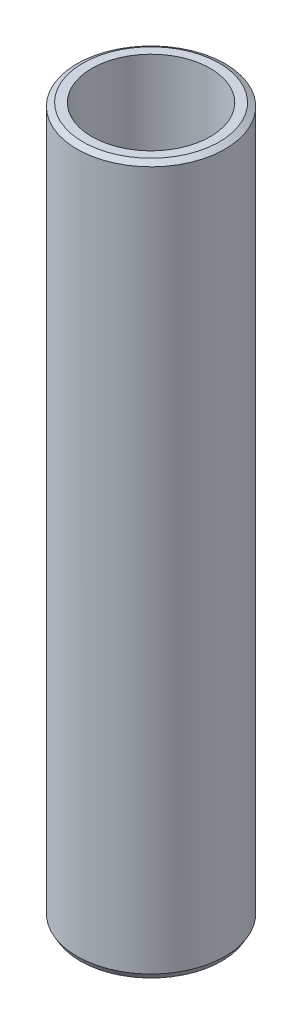
ISO-10303-21;
HEADER;
FILE_DESCRIPTION(('STEP AP214'),'2;1');
FILE_NAME('part.step','',(''),(''),'','','');
FILE_SCHEMA(('AUTOMOTIVE_DESIGN { 1 0 10303 214 1 1 1 1 }'));
ENDSEC;
DATA;
#1=APPLICATION_CONTEXT('core data for automotive mechanical design processes');
#2=APPLICATION_PROTOCOL_DEFINITION('international standard','automotive_design',2000,#1);
#3=PRODUCT_CONTEXT('',#1,'mechanical');
#4=PRODUCT('Part','Part','',(#3));
#5=PRODUCT_RELATED_PRODUCT_CATEGORY('part','',(#4));
#6=PRODUCT_DEFINITION_FORMATION('','',#4);
#7=PRODUCT_DEFINITION_CONTEXT('part definition',#1,'design');
#8=PRODUCT_DEFINITION('design','',#6,#7);
#9=PRODUCT_DEFINITION_SHAPE('','',#8);
#10=(LENGTH_UNIT() NAMED_UNIT(*) SI_UNIT(.MILLI.,.METRE.));
#11=(NAMED_UNIT(*) PLANE_ANGLE_UNIT() SI_UNIT($,.RADIAN.));
#12=(NAMED_UNIT(*) SI_UNIT($,.STERADIAN.) SOLID_ANGLE_UNIT());
#13=UNCERTAINTY_MEASURE_WITH_UNIT(LENGTH_MEASURE(1.E-05),#10,'distance_accuracy_value','');
#14=(GEOMETRIC_REPRESENTATION_CONTEXT(3) GLOBAL_UNCERTAINTY_ASSIGNED_CONTEXT((#13)) GLOBAL_UNIT_ASSIGNED_CONTEXT((#10,
#11,#12)) REPRESENTATION_CONTEXT('',''));
#15=CARTESIAN_POINT('',(0.,0.,0.));
#16=DIRECTION('',(0.,0.,1.));
#17=DIRECTION('',(1.,0.,0.));
#18=AXIS2_PLACEMENT_3D('',#15,#16,#17);
#19=CARTESIAN_POINT('',(0.,239.134616709361,0.));
#20=DIRECTION('',(0.,-1.,0.));
#21=DIRECTION('',(0.,0.,-1.));
#22=AXIS2_PLACEMENT_3D('',#19,#20,#21);
#23=CYLINDRICAL_SURFACE('',#22,25.);
#24=CARTESIAN_POINT('',(0.,238.003384160411,0.));
#25=DIRECTION('',(0.,1.,0.));
#26=DIRECTION('',(0.,0.,1.));
#27=AXIS2_PLACEMENT_3D('',#24,#25,#26);
#28=CIRCLE('',#27,25.);
#29=CARTESIAN_POINT('',(0.,238.003384160411,-25.));
#30=VERTEX_POINT('',#29);
#31=EDGE_CURVE('E50',#30,#30,#28,.F.);
#32=ORIENTED_EDGE('',*,*,#31,.T.);
#33=EDGE_LOOP('',(#32));
#34=FACE_BOUND('',#33,.T.);
#35=CARTESIAN_POINT('',(0.,1.95935224995808,0.));
#36=DIRECTION('',(0.,1.,0.));
#37=DIRECTION('',(0.,0.,1.));
#38=AXIS2_PLACEMENT_3D('',#35,#36,#37);
#39=CIRCLE('',#38,25.);
#40=CARTESIAN_POINT('',(0.,1.95935224995808,25.));
#41=VERTEX_POINT('',#40);
#42=EDGE_CURVE('E51',#41,#41,#39,.T.);
#43=ORIENTED_EDGE('',*,*,#42,.T.);
#44=EDGE_LOOP('',(#43));
#45=FACE_BOUND('',#44,.T.);
#46=ADVANCED_FACE('F39',(#34,#45),#23,.T.);
#47=CARTESIAN_POINT('',(0.,239.134616709361,0.));
#48=DIRECTION('',(0.,1.,0.));
#49=DIRECTION('',(0.,0.,1.));
#50=AXIS2_PLACEMENT_3D('',#47,#48,#49);
#51=PLANE('',#50);
#52=CARTESIAN_POINT('',(0.,239.134616709361,0.));
#53=DIRECTION('',(0.,1.,0.));
#54=DIRECTION('',(0.,0.,1.));
#55=AXIS2_PLACEMENT_3D('',#52,#53,#54);
#56=CIRCLE('',#55,23.0406477500419);
#57=CARTESIAN_POINT('',(0.,239.134616709361,-23.0406477500419));
#58=VERTEX_POINT('',#57);
#59=EDGE_CURVE('E54',#58,#58,#56,.T.);
#60=ORIENTED_EDGE('',*,*,#59,.T.);
#61=EDGE_LOOP('',(#60));
#62=FACE_BOUND('',#61,.T.);
#63=CARTESIAN_POINT('',(0.,239.134616709361,0.));
#64=DIRECTION('',(0.,1.,0.));
#65=DIRECTION('',(0.,0.,1.));
#66=AXIS2_PLACEMENT_3D('',#63,#64,#65);
#67=CIRCLE('',#66,19.9933241501493);
#68=CARTESIAN_POINT('',(0.,239.134616709361,19.9933241501493));
#69=VERTEX_POINT('',#68);
#70=EDGE_CURVE('E58',#69,#69,#67,.T.);
#71=ORIENTED_EDGE('',*,*,#70,.F.);
#72=EDGE_LOOP('',(#71));
#73=FACE_BOUND('',#72,.T.);
#74=ADVANCED_FACE('F69',(#62,#73),#51,.T.);
#75=CARTESIAN_POINT('',(0.,0.,0.));
#76=DIRECTION('',(0.,1.,0.));
#77=DIRECTION('',(0.,0.,1.));
#78=AXIS2_PLACEMENT_3D('',#75,#76,#77);
#79=PLANE('',#78);
#80=CARTESIAN_POINT('',(0.,0.,0.));
#81=DIRECTION('',(0.,1.,0.));
#82=DIRECTION('',(0.,0.,1.));
#83=AXIS2_PLACEMENT_3D('',#80,#81,#82);
#84=CIRCLE('',#83,23.8687674510494);
#85=CARTESIAN_POINT('',(0.,0.,23.8687674510494));
#86=VERTEX_POINT('',#85);
#87=EDGE_CURVE('E10',#86,#86,#84,.F.);
#88=ORIENTED_EDGE('',*,*,#87,.T.);
#89=EDGE_LOOP('',(#88));
#90=FACE_BOUND('',#89,.T.);
#91=CARTESIAN_POINT('',(0.,0.,0.));
#92=DIRECTION('',(0.,1.,0.));
#93=DIRECTION('',(0.,0.,1.));
#94=AXIS2_PLACEMENT_3D('',#91,#92,#93);
#95=CIRCLE('',#94,19.9933241501493);
#96=CARTESIAN_POINT('',(0.,0.,19.9933241501493));
#97=VERTEX_POINT('',#96);
#98=EDGE_CURVE('E63',#97,#97,#95,.T.);
#99=ORIENTED_EDGE('',*,*,#98,.T.);
#100=EDGE_LOOP('',(#99));
#101=FACE_BOUND('',#100,.T.);
#102=ADVANCED_FACE('F75',(#90,#101),#79,.F.);
#103=CARTESIAN_POINT('',(0.,239.134616709361,0.));
#104=DIRECTION('',(0.,-1.,0.));
#105=DIRECTION('',(0.,0.,-1.));
#106=AXIS2_PLACEMENT_3D('',#103,#104,#105);
#107=CYLINDRICAL_SURFACE('',#106,19.9933241501493);
#108=ORIENTED_EDGE('',*,*,#70,.T.);
#109=EDGE_LOOP('',(#108));
#110=FACE_BOUND('',#109,.T.);
#111=ORIENTED_EDGE('',*,*,#98,.F.);
#112=EDGE_LOOP('',(#111));
#113=FACE_BOUND('',#112,.T.);
#114=ADVANCED_FACE('F70',(#110,#113),#107,.F.);
#115=CARTESIAN_POINT('',(0.,239.134616709361,0.));
#116=DIRECTION('',(0.,-1.,0.));
#117=DIRECTION('',(0.,0.,-1.));
#118=AXIS2_PLACEMENT_3D('',#115,#116,#117);
#119=CONICAL_SURFACE('',#118,23.0406477500419,1.04719755119658);
#120=CARTESIAN_POINT('',(0.,238.003384160411,-25.));
#121=CARTESIAN_POINT('',(0.,238.015167832795,-24.9795900807296));
#122=CARTESIAN_POINT('',(0.,238.02695150518,-24.9591801614592));
#123=CARTESIAN_POINT('',(0.,238.05051884995,-24.9183603229184));
#124=CARTESIAN_POINT('',(0.,238.062302522335,-24.897950403648));
#125=CARTESIAN_POINT('',(0.,238.085869867105,-24.8571305651072));
#126=CARTESIAN_POINT('',(0.,238.09765353949,-24.8367206458368));
#127=CARTESIAN_POINT('',(0.,238.12122088426,-24.7959008072961));
#128=CARTESIAN_POINT('',(0.,238.133004556644,-24.7754908880257));
#129=CARTESIAN_POINT('',(0.,238.156571901414,-24.7346710494849));
#130=CARTESIAN_POINT('',(0.,238.168355573799,-24.7142611302145));
#131=CARTESIAN_POINT('',(0.,238.191922918569,-24.6734412916737));
#132=CARTESIAN_POINT('',(0.,238.203706590954,-24.6530313724033));
#133=CARTESIAN_POINT('',(0.,238.227273935724,-24.6122115338625));
#134=CARTESIAN_POINT('',(0.,238.239057608109,-24.5918016145921));
#135=CARTESIAN_POINT('',(0.,238.262624952878,-24.5509817760513));
#136=CARTESIAN_POINT('',(0.,238.274408625263,-24.5305718567809));
#137=CARTESIAN_POINT('',(0.,238.297975970033,-24.4897520182401));
#138=CARTESIAN_POINT('',(0.,238.309759642418,-24.4693420989697));
#139=CARTESIAN_POINT('',(0.,238.333326987188,-24.4285222604289));
#140=CARTESIAN_POINT('',(0.,238.345110659573,-24.4081123411585));
#141=CARTESIAN_POINT('',(0.,238.368678004343,-24.3672925026177));
#142=CARTESIAN_POINT('',(0.,238.380461676727,-24.3468825833473));
#143=CARTESIAN_POINT('',(0.,238.404029021497,-24.3060627448065));
#144=CARTESIAN_POINT('',(0.,238.415812693882,-24.2856528255361));
#145=CARTESIAN_POINT('',(0.,238.439380038652,-24.2448329869953));
#146=CARTESIAN_POINT('',(0.,238.451163711037,-24.2244230677249));
#147=CARTESIAN_POINT('',(0.,238.474731055807,-24.1836032291841));
#148=CARTESIAN_POINT('',(0.,238.486514728192,-24.1631933099137));
#149=CARTESIAN_POINT('',(0.,238.510082072961,-24.1223734713729));
#150=CARTESIAN_POINT('',(0.,238.521865745346,-24.1019635521025));
#151=CARTESIAN_POINT('',(0.,238.545433090116,-24.0611437135617));
#152=CARTESIAN_POINT('',(0.,238.557216762501,-24.0407337942914));
#153=CARTESIAN_POINT('',(0.,238.580784107271,-23.9999139557506));
#154=CARTESIAN_POINT('',(0.,238.592567779656,-23.9795040364802));
#155=CARTESIAN_POINT('',(0.,238.616135124426,-23.9386841979394));
#156=CARTESIAN_POINT('',(0.,238.62791879681,-23.918274278669));
#157=CARTESIAN_POINT('',(0.,238.65148614158,-23.8774544401282));
#158=CARTESIAN_POINT('',(0.,238.663269813965,-23.8570445208578));
#159=CARTESIAN_POINT('',(0.,238.686837158735,-23.816224682317));
#160=CARTESIAN_POINT('',(0.,238.69862083112,-23.7958147630466));
#161=CARTESIAN_POINT('',(0.,238.72218817589,-23.7549949245058));
#162=CARTESIAN_POINT('',(0.,238.733971848275,-23.7345850052354));
#163=CARTESIAN_POINT('',(0.,238.757539193044,-23.6937651666946));
#164=CARTESIAN_POINT('',(0.,238.769322865429,-23.6733552474242));
#165=CARTESIAN_POINT('',(0.,238.792890210199,-23.6325354088834));
#166=CARTESIAN_POINT('',(0.,238.804673882584,-23.612125489613));
#167=CARTESIAN_POINT('',(0.,238.828241227354,-23.5713056510722));
#168=CARTESIAN_POINT('',(0.,238.840024899739,-23.5508957318018));
#169=CARTESIAN_POINT('',(0.,238.863592244508,-23.510075893261));
#170=CARTESIAN_POINT('',(0.,238.875375916893,-23.4896659739906));
#171=CARTESIAN_POINT('',(0.,238.898943261663,-23.4488461354498));
#172=CARTESIAN_POINT('',(0.,238.910726934048,-23.4284362161794));
#173=CARTESIAN_POINT('',(0.,238.934294278818,-23.3876163776386));
#174=CARTESIAN_POINT('',(0.,238.946077951203,-23.3672064583682));
#175=CARTESIAN_POINT('',(0.,238.969645295973,-23.3263866198274));
#176=CARTESIAN_POINT('',(0.,238.981428968358,-23.305976700557));
#177=CARTESIAN_POINT('',(0.,239.004996313127,-23.2651568620163));
#178=CARTESIAN_POINT('',(0.,239.016779985512,-23.2447469427459));
#179=CARTESIAN_POINT('',(0.,239.040347330282,-23.2039271042051));
#180=CARTESIAN_POINT('',(0.,239.052131002667,-23.1835171849347));
#181=CARTESIAN_POINT('',(0.,239.075698347437,-23.1426973463939));
#182=CARTESIAN_POINT('',(0.,239.087482019822,-23.1222874271235));
#183=CARTESIAN_POINT('',(0.,239.111049364591,-23.0814675885827));
#184=CARTESIAN_POINT('',(0.,239.122833036976,-23.0610576693123));
#185=CARTESIAN_POINT('',(0.,239.134616709361,-23.0406477500419));
#186=B_SPLINE_CURVE_WITH_KNOTS('',3,(#120,#121,#122,#123,#124,#125,#126,#127,#128,#129,#130,
#131,#132,#133,#134,#135,#136,#137,#138,#139,#140,#141,#142,#143,#144,#145,#146,#147,#148,#149,
#150,#151,#152,#153,#154,#155,#156,#157,#158,#159,#160,#161,#162,#163,#164,#165,#166,#167,#168,
#169,#170,#171,#172,#173,#174,#175,#176,#177,#178,#179,#180,#181,#182,#183,#184,#185),
.UNSPECIFIED.,.F.,.F.,(4,2,2,2,2,2,2,2,2,2,2,2,2,2,2,2,2,2,2,2,2,2,2,2,2,2,2,2,2,2,2,2,4),(0.,
0.0707020343094024,0.141404068618819,0.212106102928235,0.282808137237651,0.353510171547067,
0.424212205856487,0.494914240165903,0.565616274475319,0.636318308784735,0.707020343094152,
0.777722377403554,0.84842441171297,0.919126446022387,0.989828480331803,1.06053051464122,
1.13123254895064,1.20193458326005,1.27263661756947,1.34333865187888,1.4140406861883,
1.48474272049772,1.55544475480712,1.62614678911654,1.69684882342595,1.76755085773537,
1.83825289204479,1.9089549263542,1.97965696066362,2.05035899497303,2.12106102928245,
2.19176306359187,2.26246509790128),.UNSPECIFIED.);
#187=EDGE_CURVE('BSEAM81',#30,#58,#186,.T.);
#188=ORIENTED_EDGE('',*,*,#31,.F.);
#189=ORIENTED_EDGE('',*,*,#59,.F.);
#190=ORIENTED_EDGE('',*,*,#187,.T.);
#191=ORIENTED_EDGE('',*,*,#187,.F.);
#192=EDGE_LOOP('',(#188,#190,#189,#191));
#193=FACE_BOUND('',#192,.T.);
#194=ADVANCED_FACE('F81',(#193),#119,.T.);
#195=CARTESIAN_POINT('',(0.,1.95935224995808,0.));
#196=DIRECTION('',(0.,1.,0.));
#197=DIRECTION('',(0.,0.,1.));
#198=AXIS2_PLACEMENT_3D('',#195,#196,#197);
#199=CONICAL_SURFACE('',#198,25.,0.523598775598304);
#200=ORIENTED_EDGE('',*,*,#87,.F.);
#201=EDGE_LOOP('',(#200));
#202=FACE_BOUND('',#201,.T.);
#203=ORIENTED_EDGE('',*,*,#42,.F.);
#204=EDGE_LOOP('',(#203));
#205=FACE_BOUND('',#204,.T.);
#206=ADVANCED_FACE('F45',(#202,#205),#199,.T.);
#207=CLOSED_SHELL('',(#46,#74,#102,#114,#194,#206));
#208=MANIFOLD_SOLID_BREP('B2',#207);
#209=ADVANCED_BREP_SHAPE_REPRESENTATION('',(#18,#208),#14);
#210=SHAPE_DEFINITION_REPRESENTATION(#9,#209);
ENDSEC;
END-ISO-10303-21;
